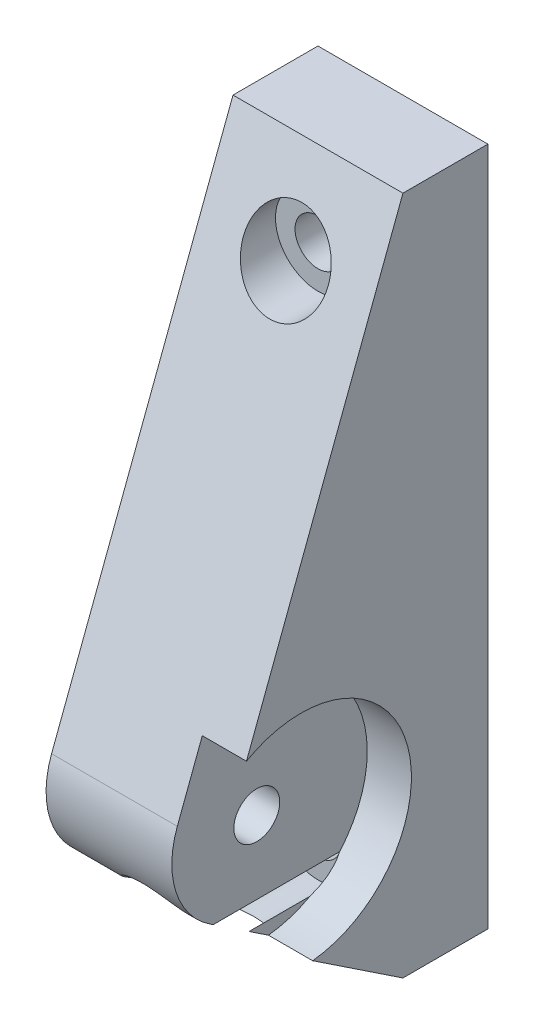
ISO-10303-21;
HEADER;
FILE_DESCRIPTION(('STEP AP214'),'2;1');
FILE_NAME('part.step','',(''),(''),'','','');
FILE_SCHEMA(('AUTOMOTIVE_DESIGN { 1 0 10303 214 1 1 1 1 }'));
ENDSEC;
DATA;
#1=APPLICATION_CONTEXT('core data for automotive mechanical design processes');
#2=APPLICATION_PROTOCOL_DEFINITION('international standard','automotive_design',2000,#1);
#3=PRODUCT_CONTEXT('',#1,'mechanical');
#4=PRODUCT('Part','Part','',(#3));
#5=PRODUCT_RELATED_PRODUCT_CATEGORY('part','',(#4));
#6=PRODUCT_DEFINITION_FORMATION('','',#4);
#7=PRODUCT_DEFINITION_CONTEXT('part definition',#1,'design');
#8=PRODUCT_DEFINITION('design','',#6,#7);
#9=PRODUCT_DEFINITION_SHAPE('','',#8);
#10=(LENGTH_UNIT() NAMED_UNIT(*) SI_UNIT(.MILLI.,.METRE.));
#11=(NAMED_UNIT(*) PLANE_ANGLE_UNIT() SI_UNIT($,.RADIAN.));
#12=(NAMED_UNIT(*) SI_UNIT($,.STERADIAN.) SOLID_ANGLE_UNIT());
#13=UNCERTAINTY_MEASURE_WITH_UNIT(LENGTH_MEASURE(1.E-05),#10,'distance_accuracy_value','');
#14=(GEOMETRIC_REPRESENTATION_CONTEXT(3) GLOBAL_UNCERTAINTY_ASSIGNED_CONTEXT((#13)) GLOBAL_UNIT_ASSIGNED_CONTEXT((#10,
#11,#12)) REPRESENTATION_CONTEXT('',''));
#15=CARTESIAN_POINT('',(0.,0.,0.));
#16=DIRECTION('',(0.,0.,1.));
#17=DIRECTION('',(1.,0.,0.));
#18=AXIS2_PLACEMENT_3D('',#15,#16,#17);
#19=CARTESIAN_POINT('',(10.,-50.,22.));
#20=DIRECTION('',(-1.,0.,0.));
#21=DIRECTION('',(0.,0.,1.));
#22=AXIS2_PLACEMENT_3D('',#19,#20,#21);
#23=CYLINDRICAL_SURFACE('',#22,10.);
#24=CARTESIAN_POINT('',(4.79999999999999,-50.,22.));
#25=DIRECTION('',(1.,0.,0.));
#26=DIRECTION('',(0.,1.,0.));
#27=AXIS2_PLACEMENT_3D('',#24,#25,#26);
#28=CIRCLE('',#27,10.);
#29=CARTESIAN_POINT('',(4.79999999999999,-46.4626425291299,31.353454021017));
#30=VERTEX_POINT('',#29);
#31=CARTESIAN_POINT('',(4.79999999999999,-58.3245531262586,27.5409218770976));
#32=VERTEX_POINT('',#31);
#33=EDGE_CURVE('E171',#30,#32,#28,.T.);
#34=ORIENTED_EDGE('',*,*,#33,.F.);
#35=DIRECTION('',(-1.,0.,0.));
#36=VECTOR('',#35,1.);
#37=CARTESIAN_POINT('',(10.,-46.4626425291299,31.353454021017));
#38=LINE('',#37,#36);
#39=CARTESIAN_POINT('',(-10.,-46.4626425291299,31.353454021017));
#40=VERTEX_POINT('',#39);
#41=EDGE_CURVE('E168',#30,#40,#38,.T.);
#42=ORIENTED_EDGE('',*,*,#41,.T.);
#43=CARTESIAN_POINT('',(-10.,-50.,22.));
#44=DIRECTION('',(1.,0.,0.));
#45=DIRECTION('',(0.,0.,-1.));
#46=AXIS2_PLACEMENT_3D('',#43,#44,#45);
#47=CIRCLE('',#46,10.);
#48=CARTESIAN_POINT('',(-10.,-58.3245531262586,27.5409218770976));
#49=VERTEX_POINT('',#48);
#50=EDGE_CURVE('E369',#40,#49,#47,.T.);
#51=ORIENTED_EDGE('',*,*,#50,.T.);
#52=DIRECTION('',(-1.,0.,0.));
#53=VECTOR('',#52,1.);
#54=CARTESIAN_POINT('',(10.,-58.3245531262586,27.5409218770976));
#55=LINE('',#54,#53);
#56=CARTESIAN_POINT('',(-4.71093173090738,-58.3245531262586,27.5409218770976));
#57=VERTEX_POINT('',#56);
#58=EDGE_CURVE('E284',#57,#49,#55,.T.);
#59=ORIENTED_EDGE('',*,*,#58,.F.);
#60=CARTESIAN_POINT('',(-5.,-60.,22.));
#61=CARTESIAN_POINT('',(-5.00000543735582,-59.9999983621273,22.2799909792406));
#62=CARTESIAN_POINT('',(-5.00004297263459,-59.9882299538663,22.5600554642195));
#63=CARTESIAN_POINT('',(-4.99970816004498,-59.9412202688655,23.1183407583302));
#64=CARTESIAN_POINT('',(-4.9993355628809,-59.9059647208023,23.3965603425891));
#65=CARTESIAN_POINT('',(-4.99668952871418,-59.812109081761,23.9497160845488));
#66=CARTESIAN_POINT('',(-4.99441157405625,-59.7534536821332,24.2246428620166));
#67=CARTESIAN_POINT('',(-4.98551463893992,-59.6132432445507,24.7684573945071));
#68=CARTESIAN_POINT('',(-4.9788970643154,-59.531695627495,25.0373470761009));
#69=CARTESIAN_POINT('',(-4.9599317049391,-59.3637682047245,25.5173615740895));
#70=CARTESIAN_POINT('',(-4.94889103440356,-59.2811615614769,25.7298638838736));
#71=CARTESIAN_POINT('',(-4.9195047352742,-59.1018149588431,26.1483449386991));
#72=CARTESIAN_POINT('',(-4.90115889024543,-59.0050745807618,26.3543234902618));
#73=CARTESIAN_POINT('',(-4.85464384182448,-58.7984935151088,26.7579190049121));
#74=CARTESIAN_POINT('',(-4.82649587778562,-58.6886814872442,26.9555530191938));
#75=CARTESIAN_POINT('',(-4.75749654580505,-58.457007869871,27.3413074982808));
#76=CARTESIAN_POINT('',(-4.71664995330747,-58.3351508217407,27.5294315085489));
#77=CARTESIAN_POINT('',(-4.63303812681507,-58.1173377336263,27.8424454268928));
#78=CARTESIAN_POINT('',(-4.59412152126642,-58.0238701997777,27.9701044781997));
#79=CARTESIAN_POINT('',(-4.50705728954444,-57.8326355912817,28.2188751390517));
#80=CARTESIAN_POINT('',(-4.45891200791514,-57.7348696135043,28.3399884015566));
#81=CARTESIAN_POINT('',(-4.35233542794369,-57.536291349379,28.5747954859367));
#82=CARTESIAN_POINT('',(-4.29391342330296,-57.4354818830569,28.6884958853243));
#83=CARTESIAN_POINT('',(-4.16578347926537,-57.2322082679789,28.9077854312126));
#84=CARTESIAN_POINT('',(-4.09607741161601,-57.1297443961813,29.0133759186717));
#85=CARTESIAN_POINT('',(-3.95724041310869,-56.9419742139825,29.1988477586529));
#86=CARTESIAN_POINT('',(-3.88994243634234,-56.8566489314387,29.2800840169888));
#87=CARTESIAN_POINT('',(-3.74673016345699,-56.6872507279237,29.4359882178753));
#88=CARTESIAN_POINT('',(-3.67081756846419,-56.6031775633935,29.5106574520628));
#89=CARTESIAN_POINT('',(-3.51029509598957,-56.4375393628271,29.6531053411727));
#90=CARTESIAN_POINT('',(-3.42568613275963,-56.355974064307,29.7208847189407));
#91=CARTESIAN_POINT('',(-3.24789296559,-56.1966544518305,29.8493277824221));
#92=CARTESIAN_POINT('',(-3.15470862709985,-56.1189001976999,29.9099913564522));
#93=CARTESIAN_POINT('',(-2.95965819367646,-55.9681661682869,30.0243372111332));
#94=CARTESIAN_POINT('',(-2.85775338900951,-55.895210525203,30.0779853745477));
#95=CARTESIAN_POINT('',(-2.64620776849355,-55.7557529090139,30.1779381937002));
#96=CARTESIAN_POINT('',(-2.53656680152415,-55.6892510620392,30.2242427059279));
#97=CARTESIAN_POINT('',(-2.31030709243293,-55.5638744415423,30.3095761633119));
#98=CARTESIAN_POINT('',(-2.19368820600765,-55.5049998258311,30.3486049579375));
#99=CARTESIAN_POINT('',(-1.95439083334124,-55.3959100941803,30.4195244224745));
#100=CARTESIAN_POINT('',(-1.83171277740433,-55.3456943644466,30.451415598391));
#101=CARTESIAN_POINT('',(-1.59193503972998,-55.2586278111119,30.505835706727));
#102=CARTESIAN_POINT('',(-1.47524234971891,-55.2210054314879,30.5289286685268));
#103=CARTESIAN_POINT('',(-1.23844580985075,-55.1542402042078,30.56944195571));
#104=CARTESIAN_POINT('',(-1.11834078412286,-55.1251003194417,30.5868602992323));
#105=CARTESIAN_POINT('',(-0.87571526448842,-55.0757292830475,30.6161358189671));
#106=CARTESIAN_POINT('',(-0.753196073350581,-55.0554934569729,30.6279959133587));
#107=CARTESIAN_POINT('',(-0.50654493283865,-55.0241712362418,30.6462728027366));
#108=CARTESIAN_POINT('',(-0.382412406281763,-55.0130882130005,30.6526875919806));
#109=CARTESIAN_POINT('',(-0.136302973633199,-55.0003737416911,30.6600412439671));
#110=CARTESIAN_POINT('',(-0.0143402508492899,-54.9985356552667,30.6610998292595));
#111=CARTESIAN_POINT('',(0.229374478277644,-55.0037765979291,30.6580730606772));
#112=CARTESIAN_POINT('',(0.351126392503349,-55.0108588509414,30.6539858470446));
#113=CARTESIAN_POINT('',(0.593451842660933,-55.0338525062965,30.640631055885));
#114=CARTESIAN_POINT('',(0.714025880758578,-55.0497599625952,30.6313657936234));
#115=CARTESIAN_POINT('',(0.953236669836751,-55.0902078067717,30.6075742444877));
#116=CARTESIAN_POINT('',(1.07187269289389,-55.1147513637677,30.5930460262524));
#117=CARTESIAN_POINT('',(1.30614382742046,-55.1721112716913,30.5586436026435));
#118=CARTESIAN_POINT('',(1.42178316581298,-55.2049151819101,30.5387774336318));
#119=CARTESIAN_POINT('',(1.64947623860589,-55.2783960203729,30.4935502475042));
#120=CARTESIAN_POINT('',(1.7615286546631,-55.3190758054752,30.4681872360894));
#121=CARTESIAN_POINT('',(1.98118032869369,-55.4077300592597,30.4118493735791));
#122=CARTESIAN_POINT('',(2.08878182196989,-55.4557008083377,30.3808773824617));
#123=CARTESIAN_POINT('',(2.29892441489056,-55.5583082066549,30.3131816033112));
#124=CARTESIAN_POINT('',(2.40146364310403,-55.6129472955266,30.2764557087924));
#125=CARTESIAN_POINT('',(2.60145574661091,-55.7284848075023,30.1969142542764));
#126=CARTESIAN_POINT('',(2.69887209426639,-55.7894208566242,30.1540614224923));
#127=CARTESIAN_POINT('',(2.88739972524779,-55.916390383908,30.0624111661055));
#128=CARTESIAN_POINT('',(2.97850872467237,-55.9824256903988,30.0136116056551));
#129=CARTESIAN_POINT('',(3.24164297734024,-56.1867459086094,29.8583271531288));
#130=CARTESIAN_POINT('',(3.40366461179998,-56.3313567600175,29.7428820173478));
#131=CARTESIAN_POINT('',(3.70609907357402,-56.6364761533102,29.4832597940605));
#132=CARTESIAN_POINT('',(3.84510641287463,-56.797414325243,29.3379719520428));
#133=CARTESIAN_POINT('',(4.09276106005842,-57.1206238184767,29.0247650499011));
#134=CARTESIAN_POINT('',(4.20139390313721,-57.2828957371927,28.8568352635627));
#135=CARTESIAN_POINT('',(4.36532741700057,-57.5582461964004,28.5500523165634));
#136=CARTESIAN_POINT('',(4.4270934949573,-57.6726739462544,28.4157556050742));
#137=CARTESIAN_POINT('',(4.53777569652121,-57.8966240337978,28.1380071929284));
#138=CARTESIAN_POINT('',(4.58668703450769,-58.0061445320423,27.9945521073839));
#139=CARTESIAN_POINT('',(4.6734146059691,-58.2188696801919,27.6994170226748));
#140=CARTESIAN_POINT('',(4.71120893103198,-58.3220615457724,27.5477214713544));
#141=CARTESIAN_POINT('',(4.77732993575131,-58.5207830607504,27.2373879658764));
#142=CARTESIAN_POINT('',(4.80565400908331,-58.6163105953455,27.0787481141285));
#143=CARTESIAN_POINT('',(4.8633191056043,-58.831800549952,26.6971345651726));
#144=CARTESIAN_POINT('',(4.88933813032538,-58.9481395417289,26.4716050188093));
#145=CARTESIAN_POINT('',(4.93077464998759,-59.1636377505289,26.0115266765605));
#146=CARTESIAN_POINT('',(4.94618838709179,-59.2627908686755,25.7769747147593));
#147=CARTESIAN_POINT('',(4.96971470524354,-59.4430430356523,25.3005798049917));
#148=CARTESIAN_POINT('',(4.97782404911881,-59.5241340677278,25.0587336734054));
#149=CARTESIAN_POINT('',(4.98945866655492,-59.6676114757841,24.5694901131549));
#150=CARTESIAN_POINT('',(4.99298437385522,-59.7299996211481,24.3220932120019));
#151=CARTESIAN_POINT('',(4.9976275476374,-59.8367858439264,23.8180679417996));
#152=CARTESIAN_POINT('',(4.99869362325633,-59.8807845562404,23.5613545001888));
#153=CARTESIAN_POINT('',(4.99985121717598,-59.948625069996,23.0452743331978));
#154=CARTESIAN_POINT('',(4.9999427182657,-59.9724665154534,22.7859075610406));
#155=CARTESIAN_POINT('',(5.00001895348314,-59.9998465167762,22.2660963089851));
#156=CARTESIAN_POINT('',(5.00000368487963,-60.0033845532645,22.005651801688));
#157=CARTESIAN_POINT('',(4.99999421575296,-59.9901356284506,21.485279692529));
#158=CARTESIAN_POINT('',(5.00000001567211,-59.9733482404514,21.2253521016337));
#159=CARTESIAN_POINT('',(4.99940341740606,-59.9173917460965,20.6868510444563));
#160=CARTESIAN_POINT('',(4.9987522819036,-59.8765381076326,20.4084511165086));
#161=CARTESIAN_POINT('',(4.99505249621834,-59.7715157964289,19.8560465364209));
#162=CARTESIAN_POINT('',(4.992003421574,-59.7073429970237,19.582042671195));
#163=CARTESIAN_POINT('',(4.98083992229349,-59.5561818578722,19.0405406474245));
#164=CARTESIAN_POINT('',(4.97272625234231,-59.4691969185259,18.7730415257645));
#165=CARTESIAN_POINT('',(4.94787567551777,-59.2731634682736,18.2467058150375));
#166=CARTESIAN_POINT('',(4.93114206960752,-59.1641234129695,17.9878659503281));
#167=CARTESIAN_POINT('',(4.8913640983522,-58.9598065950638,17.5546103834037));
#168=CARTESIAN_POINT('',(4.87155006232064,-58.8696868626302,17.3774510704501));
#169=CARTESIAN_POINT('',(4.82349827866207,-58.6795912705167,17.0296954947859));
#170=CARTESIAN_POINT('',(4.79526260033573,-58.5796178360477,16.8590976314582));
#171=CARTESIAN_POINT('',(4.72843256766302,-58.3709182123089,16.5258504237983));
#172=CARTESIAN_POINT('',(4.68985655057786,-58.2622077536963,16.3631876054988));
#173=CARTESIAN_POINT('',(4.60022849682021,-58.0372085317342,16.0467723265841));
#174=CARTESIAN_POINT('',(4.54917984137825,-57.9209218284978,15.8930174650464));
#175=CARTESIAN_POINT('',(4.44645616373268,-57.7110651116969,15.6312848797945));
#176=CARTESIAN_POINT('',(4.39783792791745,-57.6186965853337,15.5211392453894));
#177=CARTESIAN_POINT('',(4.29131827610624,-57.4317009590116,15.3074700244708));
#178=CARTESIAN_POINT('',(4.23341930224405,-57.3370744587762,15.2039447058853));
#179=CARTESIAN_POINT('',(4.10760240581564,-57.1468257536199,15.0041506164665));
#180=CARTESIAN_POINT('',(4.03968574031347,-57.0512036750258,14.9078809374506));
#181=CARTESIAN_POINT('',(3.8932785096194,-56.8604403719002,14.7231886948359));
#182=CARTESIAN_POINT('',(3.81478783115176,-56.7652991525314,14.6347662153182));
#183=CARTESIAN_POINT('',(3.64617388441189,-56.5763187985001,14.465528022276));
#184=CARTESIAN_POINT('',(3.55595103204989,-56.4824994590982,14.3847890579905));
#185=CARTESIAN_POINT('',(3.36445734878322,-56.2989170341731,14.2322530850792));
#186=CARTESIAN_POINT('',(3.26318623510566,-56.2091540525529,14.1604563054234));
#187=CARTESIAN_POINT('',(3.05002395623394,-56.0356298263225,14.0260915807756));
#188=CARTESIAN_POINT('',(2.93813769862896,-55.9518658393897,13.9635194049107));
#189=CARTESIAN_POINT('',(2.70443645380492,-55.7921450049577,13.8476508258962));
#190=CARTESIAN_POINT('',(2.58262307369867,-55.71618689824,13.7943529256868));
#191=CARTESIAN_POINT('',(2.34833757981186,-55.5840395131709,13.7039793943331));
#192=CARTESIAN_POINT('',(2.2370527484488,-55.5265791273199,13.6656727249594));
#193=CARTESIAN_POINT('',(2.00876865681304,-55.4195266499953,13.5956663871247));
#194=CARTESIAN_POINT('',(1.89176984687731,-55.3699339397496,13.5639661990196));
#195=CARTESIAN_POINT('',(1.65297590155663,-55.2794095282919,13.5070207258276));
#196=CARTESIAN_POINT('',(1.53118161225277,-55.2384763073095,13.4817743079193));
#197=CARTESIAN_POINT('',(1.28374749585496,-55.1658906173589,13.4375597536905));
#198=CARTESIAN_POINT('',(1.15810774510917,-55.1342379642654,13.418591492811));
#199=CARTESIAN_POINT('',(0.911945408817211,-55.0823605241731,13.3877724955207));
#200=CARTESIAN_POINT('',(0.79159293526991,-55.0615457360818,13.3755513880955));
#201=CARTESIAN_POINT('',(0.549231822148058,-55.028752503991,13.3563890385459));
#202=CARTESIAN_POINT('',(0.427222652964941,-55.0167769568155,13.3494495272998));
#203=CARTESIAN_POINT('',(0.182531354187693,-55.0018303520892,13.3407986650838));
#204=CARTESIAN_POINT('',(0.0598495893349167,-54.9988548206499,13.3390847164945));
#205=CARTESIAN_POINT('',(-0.185408496514473,-55.0019334622896,13.3408623470437));
#206=CARTESIAN_POINT('',(-0.307984762065647,-55.0079909599969,13.3443558427946));
#207=CARTESIAN_POINT('',(-0.55117134675429,-55.0289848181052,13.3565367452333));
#208=CARTESIAN_POINT('',(-0.671789528193169,-55.0438532507725,13.3651844188043));
#209=CARTESIAN_POINT('',(-0.911192613539106,-55.0822332626403,13.3877180884489));
#210=CARTESIAN_POINT('',(-1.02997683299697,-55.1057479911647,13.4016059932708));
#211=CARTESIAN_POINT('',(-1.26477080733836,-55.1611058951487,13.4347198290215));
#212=CARTESIAN_POINT('',(-1.38078180290759,-55.1929452672285,13.4539433224622));
#213=CARTESIAN_POINT('',(-1.6093131329864,-55.2645533690793,13.4978684373472));
#214=CARTESIAN_POINT('',(-1.72183217531281,-55.3043249946535,13.5225720597761));
#215=CARTESIAN_POINT('',(-1.94264343095203,-55.3912879466228,13.5776094853225));
#216=CARTESIAN_POINT('',(-2.05093244271,-55.4384847620651,13.6079474566327));
#217=CARTESIAN_POINT('',(-2.26251772937766,-55.5396447215201,13.6743770756661));
#218=CARTESIAN_POINT('',(-2.36581217354962,-55.5936103209403,13.7104708126159));
#219=CARTESIAN_POINT('',(-2.56668194460778,-55.7075103387207,13.7884785590019));
#220=CARTESIAN_POINT('',(-2.66426000858945,-55.767441862774,13.8303897500148));
#221=CARTESIAN_POINT('',(-2.85325034521811,-55.8924694386845,13.9201035360479));
#222=CARTESIAN_POINT('',(-2.94466040762755,-55.9575673238585,13.9679082257746));
#223=CARTESIAN_POINT('',(-3.1225606613433,-56.0932922959295,14.0703630300312));
#224=CARTESIAN_POINT('',(-3.20892281630988,-56.1640015017397,14.1251268811224));
#225=CARTESIAN_POINT('',(-3.37450768281391,-56.3088182237937,14.2406552578269));
#226=CARTESIAN_POINT('',(-3.45372741847667,-56.3829271372934,14.3014222627456));
#227=CARTESIAN_POINT('',(-3.68038900580261,-56.6088192342266,14.4925265325462));
#228=CARTESIAN_POINT('',(-3.81696267205468,-56.764268957373,14.6317415732882));
#229=CARTESIAN_POINT('',(-4.00550411253702,-57.0053974721672,14.8628868634923));
#230=CARTESIAN_POINT('',(-4.06764733839662,-57.0905569471211,14.9474186901127));
#231=CARTESIAN_POINT('',(-4.18389683179598,-57.2603706682556,15.1223667898039));
#232=CARTESIAN_POINT('',(-4.23800281664755,-57.3450248965651,15.2127832696906));
#233=CARTESIAN_POINT('',(-4.33863603806454,-57.5128679514617,15.3990495621269));
#234=CARTESIAN_POINT('',(-4.38516131905166,-57.5960563950029,15.4949007680923));
#235=CARTESIAN_POINT('',(-4.47121065826034,-57.7601654664286,15.6915731696651));
#236=CARTESIAN_POINT('',(-4.51073324306758,-57.8410856140406,15.7923954055196));
#237=CARTESIAN_POINT('',(-4.6041191798885,-58.0452840933308,16.0573486381729));
#238=CARTESIAN_POINT('',(-4.65331332649454,-58.1664114838724,16.2248041895108));
#239=CARTESIAN_POINT('',(-4.73851734440915,-58.3994195220795,16.5692490348584));
#240=CARTESIAN_POINT('',(-4.77452111108903,-58.5112958697783,16.746242699837));
#241=CARTESIAN_POINT('',(-4.83590533809173,-58.7247027610216,17.1087904919527));
#242=CARTESIAN_POINT('',(-4.86125546661147,-58.8262031507256,17.2943674133578));
#243=CARTESIAN_POINT('',(-4.9035056621985,-59.0175408120546,17.6723163966178));
#244=CARTESIAN_POINT('',(-4.92040604372667,-59.1073785176191,17.8646882053129));
#245=CARTESIAN_POINT('',(-4.95177166994207,-59.2986618244495,18.3109049208574));
#246=CARTESIAN_POINT('',(-4.96416424821706,-59.3960991784792,18.5666206012138));
#247=CARTESIAN_POINT('',(-4.98221957755615,-59.5697592495341,19.0854494901649));
#248=CARTESIAN_POINT('',(-4.98787974171828,-59.6459738031775,19.348565502581));
#249=CARTESIAN_POINT('',(-4.99542526174576,-59.7764266540513,19.8796045735623));
#250=CARTESIAN_POINT('',(-4.99731901304157,-59.8307136125368,20.1475155947845));
#251=CARTESIAN_POINT('',(-4.99950188184151,-59.9171515401133,20.6867582698915));
#252=CARTESIAN_POINT('',(-4.9997919577134,-59.9493157198669,20.95808778366));
#253=CARTESIAN_POINT('',(-4.99996841907762,-59.9802148787248,21.358267590223));
#254=CARTESIAN_POINT('',(-4.99998722241698,-59.9876327898371,21.4864992574349));
#255=CARTESIAN_POINT('',(-5.00000176545303,-59.99752565041,21.7431487981879));
#256=CARTESIAN_POINT('',(-4.9999975058563,-60.0000007513008,21.8715666659039));
#257=CARTESIAN_POINT('',(-5.,-60.,22.));
#258=B_SPLINE_CURVE_WITH_KNOTS('',3,(#60,#61,#62,#63,#64,#65,#66,#67,#68,#69,#70,#71,#72,#73,
#74,#75,#76,#77,#78,#79,#80,#81,#82,#83,#84,#85,#86,#87,#88,#89,#90,#91,#92,#93,#94,#95,#96,#97,
#98,#99,#100,#101,#102,#103,#104,#105,#106,#107,#108,#109,#110,#111,#112,#113,#114,#115,#116,
#117,#118,#119,#120,#121,#122,#123,#124,#125,#126,#127,#128,#129,#130,#131,#132,#133,#134,#135,
#136,#137,#138,#139,#140,#141,#142,#143,#144,#145,#146,#147,#148,#149,#150,#151,#152,#153,#154,
#155,#156,#157,#158,#159,#160,#161,#162,#163,#164,#165,#166,#167,#168,#169,#170,#171,#172,#173,
#174,#175,#176,#177,#178,#179,#180,#181,#182,#183,#184,#185,#186,#187,#188,#189,#190,#191,#192,
#193,#194,#195,#196,#197,#198,#199,#200,#201,#202,#203,#204,#205,#206,#207,#208,#209,#210,#211,
#212,#213,#214,#215,#216,#217,#218,#219,#220,#221,#222,#223,#224,#225,#226,#227,#228,#229,#230,
#231,#232,#233,#234,#235,#236,#237,#238,#239,#240,#241,#242,#243,#244,#245,#246,#247,#248,#249,
#250,#251,#252,#253,#254,#255,#256,#257),.UNSPECIFIED.,.T.,.F.,(4,2,2,2,2,2,2,2,2,2,2,2,2,2,2,2,
2,2,2,2,2,2,2,2,2,2,2,2,2,2,2,2,2,2,2,2,2,2,2,2,2,2,2,2,2,2,2,2,2,2,2,2,2,2,2,2,2,2,2,2,2,2,2,2,
2,2,2,2,2,2,2,2,2,2,2,2,2,2,2,2,2,2,2,2,2,2,2,2,2,2,2,2,2,2,2,2,2,2,4),(0.,0.839854082794809,
1.68021894615517,2.52258200472724,3.36467231178483,4.04886548622183,4.73307893318347,
5.41581894921268,6.09830252408673,6.58671064131151,7.07499484257068,7.56283971568059,
8.05060375013158,8.45723472268407,8.86378553720438,9.2702936545437,9.67680815121662,
10.0852313871652,10.4936626035798,10.9021022692778,11.3105129703938,11.6843480370782,
12.0583135260908,12.4320824560505,12.8059890016646,13.1714998267601,13.5371427900889,
13.9026223938135,14.2682362546618,14.6333027331258,14.9985018830564,15.3635153422146,
15.7286627452466,16.0961342433306,16.4637381149066,17.1982583981912,17.9679361279897,
18.7379797683634,19.298063334938,19.8583551175392,20.4197437867831,20.9812868298512,
21.7454860983972,22.5099560111201,23.2747645563408,24.0395007241417,24.8200757771336,
25.6006646150637,26.3812734209841,27.161898614715,28.005030659885,28.8483119822776,
29.6914676757031,30.5343007264674,31.1330853181193,31.731722902099,32.3293058233289,
32.9267269240996,33.3815761589062,33.8363059005601,34.2909786291921,34.7456562289625,
35.2044815263627,35.6633185698472,36.1219445081816,36.5804963459917,36.9729010209589,
37.3652748190071,37.7575796968595,38.1498767908992,38.5176866718307,38.8856170391214,
39.253364478931,39.6212473024846,39.9863301774456,40.3515461620113,40.7165955766663,
41.081778503525,41.4472326702827,41.8128197927232,42.178230410798,42.5437712820247,
42.9163252213777,43.2890336741044,44.0339151818247,44.4390141879709,44.8441274390054,
45.2493450313635,45.6546477832373,46.2910068136749,46.9276599859648,47.5661136810234,
48.2045436139911,49.0252389809783,49.8462495949597,50.6654280950577,51.4841169953405,
51.8693742813495,52.2546197642578),.UNSPECIFIED.);
#259=CARTESIAN_POINT('',(4.71093173090738,-58.3245531262586,27.5409218770976));
#260=VERTEX_POINT('',#259);
#261=EDGE_CURVE('E198',#57,#260,#258,.T.);
#262=ORIENTED_EDGE('',*,*,#261,.T.);
#263=EDGE_CURVE('E255',#32,#260,#55,.T.);
#264=ORIENTED_EDGE('',*,*,#263,.F.);
#265=EDGE_LOOP('',(#34,#42,#51,#59,#262,#264));
#266=FACE_BOUND('',#265,.T.);
#267=ADVANCED_FACE('F41',(#266),#23,.T.);
#268=CARTESIAN_POINT('',(10.,-58.3245531262586,27.5409218770976));
#269=DIRECTION('',(0.,0.832455312625856,-0.554092187709761));
#270=DIRECTION('',(0.,0.554092187709761,0.832455312625856));
#271=AXIS2_PLACEMENT_3D('',#268,#269,#270);
#272=PLANE('',#271);
#273=DIRECTION('',(0.,-0.554092187709761,-0.832455312625856));
#274=VECTOR('',#273,1.);
#275=CARTESIAN_POINT('',(4.79999999999999,-58.3245531262586,27.5409218770976));
#276=LINE('',#275,#274);
#277=CARTESIAN_POINT('',(4.79999999999999,-58.6,27.1270968521681));
#278=VERTEX_POINT('',#277);
#279=EDGE_CURVE('E60',#32,#278,#276,.T.);
#280=ORIENTED_EDGE('',*,*,#279,.F.);
#281=ORIENTED_EDGE('',*,*,#263,.T.);
#282=CARTESIAN_POINT('',(0.,-60.,25.0237691685685));
#283=DIRECTION('',(0.,0.832455312625856,-0.554092187709761));
#284=DIRECTION('',(0.,-0.554092187709761,-0.832455312625856));
#285=AXIS2_PLACEMENT_3D('',#282,#283,#284);
#286=ELLIPSE('',#285,9.02376916856849,5.);
#287=EDGE_CURVE('E258',#260,#278,#286,.T.);
#288=ORIENTED_EDGE('',*,*,#287,.T.);
#289=EDGE_LOOP('',(#280,#281,#288));
#290=FACE_BOUND('',#289,.T.);
#291=ADVANCED_FACE('F247',(#290),#272,.F.);
#292=CARTESIAN_POINT('',(10.,-50.,22.));
#293=DIRECTION('',(-1.,0.,0.));
#294=DIRECTION('',(0.,0.,1.));
#295=AXIS2_PLACEMENT_3D('',#292,#293,#294);
#296=CYLINDRICAL_SURFACE('',#295,2.70000000000001);
#297=CARTESIAN_POINT('',(-10.,-50.,22.));
#298=DIRECTION('',(1.,0.,0.));
#299=DIRECTION('',(0.,0.,-1.));
#300=AXIS2_PLACEMENT_3D('',#297,#298,#299);
#301=CIRCLE('',#300,2.70000000000001);
#302=CARTESIAN_POINT('',(-10.,-50.,19.3));
#303=VERTEX_POINT('',#302);
#304=EDGE_CURVE('E373',#303,#303,#301,.T.);
#305=ORIENTED_EDGE('',*,*,#304,.F.);
#306=EDGE_LOOP('',(#305));
#307=FACE_BOUND('',#306,.T.);
#308=CARTESIAN_POINT('',(4.79999999999999,-50.,22.));
#309=DIRECTION('',(1.,0.,0.));
#310=DIRECTION('',(0.,1.,0.));
#311=AXIS2_PLACEMENT_3D('',#308,#309,#310);
#312=CIRCLE('',#311,2.70000000000001);
#313=CARTESIAN_POINT('',(4.79999999999999,-47.3,22.));
#314=VERTEX_POINT('',#313);
#315=EDGE_CURVE('E176',#314,#314,#312,.T.);
#316=ORIENTED_EDGE('',*,*,#315,.T.);
#317=EDGE_LOOP('',(#316));
#318=FACE_BOUND('',#317,.T.);
#319=ADVANCED_FACE('F217',(#307,#318),#296,.F.);
#320=CARTESIAN_POINT('',(0.,-60.,32.));
#321=DIRECTION('',(0.,0.,-1.));
#322=DIRECTION('',(-1.,0.,0.));
#323=AXIS2_PLACEMENT_3D('',#320,#321,#322);
#324=CYLINDRICAL_SURFACE('',#323,5.);
#325=CARTESIAN_POINT('',(0.,-60.,10.));
#326=DIRECTION('',(0.,0.,-1.));
#327=DIRECTION('',(-1.,0.,0.));
#328=AXIS2_PLACEMENT_3D('',#325,#326,#327);
#329=CIRCLE('',#328,5.);
#330=CARTESIAN_POINT('',(-5.,-60.,10.));
#331=VERTEX_POINT('',#330);
#332=EDGE_CURVE('E194',#331,#331,#329,.T.);
#333=ORIENTED_EDGE('',*,*,#332,.T.);
#334=EDGE_LOOP('',(#333));
#335=FACE_BOUND('',#334,.T.);
#336=DIRECTION('',(0.,0.,-1.));
#337=VECTOR('',#336,1.);
#338=CARTESIAN_POINT('',(4.79999999999999,-61.4,32.));
#339=LINE('',#338,#337);
#340=CARTESIAN_POINT('',(4.79999999999999,-61.4,15.7518002592747));
#341=VERTEX_POINT('',#340);
#342=CARTESIAN_POINT('',(4.79999999999999,-61.4,22.9204414849689));
#343=VERTEX_POINT('',#342);
#344=EDGE_CURVE('E11',#341,#343,#339,.F.);
#345=ORIENTED_EDGE('',*,*,#344,.F.);
#346=CARTESIAN_POINT('',(4.79999999999999,-61.4,15.7518002592747));
#347=CARTESIAN_POINT('',(4.82083168131789,-61.3285660910259,15.6214704994124));
#348=CARTESIAN_POINT('',(4.84060981292041,-61.2548337715501,15.4922448802154));
#349=CARTESIAN_POINT('',(4.87750012646439,-61.1027792610663,15.2360883256162));
#350=CARTESIAN_POINT('',(4.89461157783192,-61.0244558203165,15.1091580274387));
#351=CARTESIAN_POINT('',(4.94120510087942,-60.7820747284133,14.7311178116487));
#352=CARTESIAN_POINT('',(4.96578407222817,-60.6111341289216,14.4837229330927));
#353=CARTESIAN_POINT('',(4.99648443823439,-60.256753780958,14.0072048844272));
#354=CARTESIAN_POINT('',(5.00308895015903,-60.0737795307321,13.7777679661931));
#355=CARTESIAN_POINT('',(4.99419530657937,-59.6931801616539,13.3323739674558));
#356=CARTESIAN_POINT('',(4.97874298327978,-59.4955862295016,13.116389905517));
#357=CARTESIAN_POINT('',(4.93363472474345,-59.1802561707802,12.7941074517677));
#358=CARTESIAN_POINT('',(4.9135372525814,-59.066728608053,12.6823013065325));
#359=CARTESIAN_POINT('',(4.86403402789924,-58.8358681233977,12.4630697451041));
#360=CARTESIAN_POINT('',(4.83456066765984,-58.7185132994262,12.3556827529691));
#361=CARTESIAN_POINT('',(4.79999999999999,-58.6,12.2511539144368));
#362=B_SPLINE_CURVE_WITH_KNOTS('',3,(#346,#347,#348,#349,#350,#351,#352,#353,#354,#355,#356,
#357,#358,#359,#360,#361),.UNSPECIFIED.,.F.,.F.,(4,2,2,2,2,2,2,4),(0.,0.450172662840693,
0.900468440715618,1.80438455366518,2.68375344363145,3.56129773850251,4.04276975286438,
4.52779541574748),.UNSPECIFIED.);
#363=CARTESIAN_POINT('',(4.79999999999999,-58.6,12.2511539144368));
#364=VERTEX_POINT('',#363);
#365=EDGE_CURVE('E50',#341,#364,#362,.T.);
#366=ORIENTED_EDGE('',*,*,#365,.T.);
#367=DIRECTION('',(0.,0.,-1.));
#368=VECTOR('',#367,1.);
#369=CARTESIAN_POINT('',(4.79999999999999,-58.6,32.));
#370=LINE('',#369,#368);
#371=EDGE_CURVE('E161',#278,#364,#370,.T.);
#372=ORIENTED_EDGE('',*,*,#371,.F.);
#373=ORIENTED_EDGE('',*,*,#287,.F.);
#374=ORIENTED_EDGE('',*,*,#261,.F.);
#375=EDGE_CURVE('E71',#343,#57,#286,.T.);
#376=ORIENTED_EDGE('',*,*,#375,.F.);
#377=EDGE_LOOP('',(#345,#366,#372,#373,#374,#376));
#378=FACE_BOUND('',#377,.T.);
#379=ADVANCED_FACE('F211',(#335,#378),#324,.F.);
#380=CARTESIAN_POINT('',(0.,0.,0.));
#381=DIRECTION('',(0.,0.,1.));
#382=DIRECTION('',(1.,0.,0.));
#383=AXIS2_PLACEMENT_3D('',#380,#381,#382);
#384=PLANE('',#383);
#385=DIRECTION('',(0.,-1.,0.));
#386=VECTOR('',#385,1.);
#387=CARTESIAN_POINT('',(-10.,10.,0.));
#388=LINE('',#387,#386);
#389=CARTESIAN_POINT('',(-10.,10.,0.));
#390=VERTEX_POINT('',#389);
#391=CARTESIAN_POINT('',(-9.99999999999999,-70.,0.));
#392=VERTEX_POINT('',#391);
#393=EDGE_CURVE('E268',#390,#392,#388,.T.);
#394=ORIENTED_EDGE('',*,*,#393,.F.);
#395=DIRECTION('',(-1.,0.,0.));
#396=VECTOR('',#395,1.);
#397=CARTESIAN_POINT('',(-10.,10.,0.));
#398=LINE('',#397,#396);
#399=CARTESIAN_POINT('',(10.,10.,0.));
#400=VERTEX_POINT('',#399);
#401=EDGE_CURVE('E275',#400,#390,#398,.T.);
#402=ORIENTED_EDGE('',*,*,#401,.F.);
#403=DIRECTION('',(0.,1.,0.));
#404=VECTOR('',#403,1.);
#405=CARTESIAN_POINT('',(10.,10.,0.));
#406=LINE('',#405,#404);
#407=CARTESIAN_POINT('',(9.99999999999999,-70.,0.));
#408=VERTEX_POINT('',#407);
#409=EDGE_CURVE('E274',#408,#400,#406,.T.);
#410=ORIENTED_EDGE('',*,*,#409,.F.);
#411=DIRECTION('',(1.,0.,0.));
#412=VECTOR('',#411,1.);
#413=CARTESIAN_POINT('',(-9.99999999999999,-70.,0.));
#414=LINE('',#413,#412);
#415=EDGE_CURVE('E276',#392,#408,#414,.T.);
#416=ORIENTED_EDGE('',*,*,#415,.F.);
#417=EDGE_LOOP('',(#394,#402,#410,#416));
#418=FACE_BOUND('',#417,.T.);
#419=CARTESIAN_POINT('',(0.,0.,0.));
#420=DIRECTION('',(0.,0.,1.));
#421=DIRECTION('',(1.,0.,0.));
#422=AXIS2_PLACEMENT_3D('',#419,#420,#421);
#423=CIRCLE('',#422,2.7);
#424=CARTESIAN_POINT('',(2.7,0.,0.));
#425=VERTEX_POINT('',#424);
#426=EDGE_CURVE('E272',#425,#425,#423,.T.);
#427=ORIENTED_EDGE('',*,*,#426,.T.);
#428=EDGE_LOOP('',(#427));
#429=FACE_BOUND('',#428,.T.);
#430=CARTESIAN_POINT('',(0.,-60.,0.));
#431=DIRECTION('',(0.,0.,1.));
#432=DIRECTION('',(1.,0.,0.));
#433=AXIS2_PLACEMENT_3D('',#430,#431,#432);
#434=CIRCLE('',#433,2.7);
#435=CARTESIAN_POINT('',(2.7,-60.,0.));
#436=VERTEX_POINT('',#435);
#437=EDGE_CURVE('E269',#436,#436,#434,.T.);
#438=ORIENTED_EDGE('',*,*,#437,.T.);
#439=EDGE_LOOP('',(#438));
#440=FACE_BOUND('',#439,.T.);
#441=ADVANCED_FACE('F216',(#418,#429,#440),#384,.F.);
#442=CARTESIAN_POINT('',(-10.,10.,10.));
#443=DIRECTION('',(1.,0.,0.));
#444=DIRECTION('',(0.,1.,0.));
#445=AXIS2_PLACEMENT_3D('',#442,#443,#444);
#446=PLANE('',#445);
#447=ORIENTED_EDGE('',*,*,#393,.T.);
#448=DIRECTION('',(0.,0.,-1.));
#449=VECTOR('',#448,1.);
#450=CARTESIAN_POINT('',(-9.99999999999999,-70.,10.));
#451=LINE('',#450,#449);
#452=CARTESIAN_POINT('',(-9.99999999999999,-70.,10.));
#453=VERTEX_POINT('',#452);
#454=EDGE_CURVE('E289',#453,#392,#451,.T.);
#455=ORIENTED_EDGE('',*,*,#454,.F.);
#456=DIRECTION('',(0.,-0.554092187709761,-0.832455312625856));
#457=VECTOR('',#456,1.);
#458=CARTESIAN_POINT('',(-10.,-58.3245531262586,27.5409218770976));
#459=LINE('',#458,#457);
#460=EDGE_CURVE('E281',#49,#453,#459,.T.);
#461=ORIENTED_EDGE('',*,*,#460,.F.);
#462=ORIENTED_EDGE('',*,*,#50,.F.);
#463=DIRECTION('',(0.,-0.935345402101703,0.353735747087007));
#464=VECTOR('',#463,1.);
#465=CARTESIAN_POINT('',(-10.,10.,10.));
#466=LINE('',#465,#464);
#467=CARTESIAN_POINT('',(-10.,10.,10.));
#468=VERTEX_POINT('',#467);
#469=EDGE_CURVE('E356',#468,#40,#466,.T.);
#470=ORIENTED_EDGE('',*,*,#469,.F.);
#471=DIRECTION('',(0.,0.,-1.));
#472=VECTOR('',#471,1.);
#473=CARTESIAN_POINT('',(-10.,10.,10.));
#474=LINE('',#473,#472);
#475=EDGE_CURVE('E351',#468,#390,#474,.T.);
#476=ORIENTED_EDGE('',*,*,#475,.T.);
#477=EDGE_LOOP('',(#447,#455,#461,#462,#470,#476));
#478=FACE_BOUND('',#477,.T.);
#479=ORIENTED_EDGE('',*,*,#304,.T.);
#480=EDGE_LOOP('',(#479));
#481=FACE_BOUND('',#480,.T.);
#482=ADVANCED_FACE('F43',(#478,#481),#446,.F.);
#483=CARTESIAN_POINT('',(-9.99999999999999,-70.,10.));
#484=DIRECTION('',(0.,1.,0.));
#485=DIRECTION('',(0.,0.,1.));
#486=AXIS2_PLACEMENT_3D('',#483,#484,#485);
#487=PLANE('',#486);
#488=ORIENTED_EDGE('',*,*,#415,.T.);
#489=DIRECTION('',(0.,0.,-1.));
#490=VECTOR('',#489,1.);
#491=CARTESIAN_POINT('',(9.99999999999999,-70.,10.));
#492=LINE('',#491,#490);
#493=CARTESIAN_POINT('',(9.99999999999999,-70.,10.));
#494=VERTEX_POINT('',#493);
#495=EDGE_CURVE('E330',#494,#408,#492,.T.);
#496=ORIENTED_EDGE('',*,*,#495,.F.);
#497=DIRECTION('',(1.,0.,0.));
#498=VECTOR('',#497,1.);
#499=CARTESIAN_POINT('',(-9.99999999999999,-70.,10.));
#500=LINE('',#499,#498);
#501=EDGE_CURVE('E345',#453,#494,#500,.T.);
#502=ORIENTED_EDGE('',*,*,#501,.F.);
#503=ORIENTED_EDGE('',*,*,#454,.T.);
#504=EDGE_LOOP('',(#488,#496,#502,#503));
#505=FACE_BOUND('',#504,.T.);
#506=ADVANCED_FACE('F319',(#505),#487,.F.);
#507=CARTESIAN_POINT('',(10.,10.,10.));
#508=DIRECTION('',(-1.,0.,0.));
#509=DIRECTION('',(0.,-1.,0.));
#510=AXIS2_PLACEMENT_3D('',#507,#508,#509);
#511=PLANE('',#510);
#512=DIRECTION('',(0.,-0.935345402101703,0.353735747087007));
#513=VECTOR('',#512,1.);
#514=CARTESIAN_POINT('',(10.,10.,10.));
#515=LINE('',#514,#513);
#516=CARTESIAN_POINT('',(10.,10.,10.));
#517=VERTEX_POINT('',#516);
#518=CARTESIAN_POINT('',(9.99999999999999,-38.6930800919612,28.4151042230969));
#519=VERTEX_POINT('',#518);
#520=EDGE_CURVE('E279',#517,#519,#515,.T.);
#521=ORIENTED_EDGE('',*,*,#520,.T.);
#522=CARTESIAN_POINT('',(9.99999999999999,-50.,22.));
#523=DIRECTION('',(1.,0.,0.));
#524=DIRECTION('',(0.,1.,0.));
#525=AXIS2_PLACEMENT_3D('',#522,#523,#524);
#526=CIRCLE('',#525,13.);
#527=CARTESIAN_POINT('',(9.99999999999999,-62.9271885149449,20.6260287124267));
#528=VERTEX_POINT('',#527);
#529=EDGE_CURVE('E149',#528,#519,#526,.T.);
#530=ORIENTED_EDGE('',*,*,#529,.F.);
#531=DIRECTION('',(0.,-0.554092187709761,-0.832455312625856));
#532=VECTOR('',#531,1.);
#533=CARTESIAN_POINT('',(10.,-58.3245531262586,27.5409218770976));
#534=LINE('',#533,#532);
#535=EDGE_CURVE('E280',#528,#494,#534,.T.);
#536=ORIENTED_EDGE('',*,*,#535,.T.);
#537=ORIENTED_EDGE('',*,*,#495,.T.);
#538=ORIENTED_EDGE('',*,*,#409,.T.);
#539=DIRECTION('',(0.,0.,-1.));
#540=VECTOR('',#539,1.);
#541=CARTESIAN_POINT('',(10.,10.,10.));
#542=LINE('',#541,#540);
#543=EDGE_CURVE('E341',#517,#400,#542,.T.);
#544=ORIENTED_EDGE('',*,*,#543,.F.);
#545=EDGE_LOOP('',(#521,#530,#536,#537,#538,#544));
#546=FACE_BOUND('',#545,.T.);
#547=ADVANCED_FACE('F316',(#546),#511,.F.);
#548=CARTESIAN_POINT('',(-10.,10.,10.));
#549=DIRECTION('',(0.,-1.,0.));
#550=DIRECTION('',(0.,0.,-1.));
#551=AXIS2_PLACEMENT_3D('',#548,#549,#550);
#552=PLANE('',#551);
#553=ORIENTED_EDGE('',*,*,#401,.T.);
#554=ORIENTED_EDGE('',*,*,#475,.F.);
#555=DIRECTION('',(-1.,0.,0.));
#556=VECTOR('',#555,1.);
#557=CARTESIAN_POINT('',(-10.,10.,10.));
#558=LINE('',#557,#556);
#559=EDGE_CURVE('E348',#517,#468,#558,.T.);
#560=ORIENTED_EDGE('',*,*,#559,.F.);
#561=ORIENTED_EDGE('',*,*,#543,.T.);
#562=EDGE_LOOP('',(#553,#554,#560,#561));
#563=FACE_BOUND('',#562,.T.);
#564=ADVANCED_FACE('F309',(#563),#552,.F.);
#565=CARTESIAN_POINT('',(0.,0.,10.));
#566=DIRECTION('',(0.,0.,-1.));
#567=DIRECTION('',(-1.,0.,0.));
#568=AXIS2_PLACEMENT_3D('',#565,#566,#567);
#569=CYLINDRICAL_SURFACE('',#568,2.7);
#570=CARTESIAN_POINT('',(0.,0.,10.));
#571=DIRECTION('',(0.,0.,-1.));
#572=DIRECTION('',(-1.,0.,0.));
#573=AXIS2_PLACEMENT_3D('',#570,#571,#572);
#574=CIRCLE('',#573,2.7);
#575=CARTESIAN_POINT('',(-2.7,0.,10.));
#576=VERTEX_POINT('',#575);
#577=EDGE_CURVE('E190',#576,#576,#574,.T.);
#578=ORIENTED_EDGE('',*,*,#577,.F.);
#579=EDGE_LOOP('',(#578));
#580=FACE_BOUND('',#579,.T.);
#581=ORIENTED_EDGE('',*,*,#426,.F.);
#582=EDGE_LOOP('',(#581));
#583=FACE_BOUND('',#582,.T.);
#584=ADVANCED_FACE('F303',(#580,#583),#569,.F.);
#585=CARTESIAN_POINT('',(0.,-60.,10.));
#586=DIRECTION('',(0.,0.,-1.));
#587=DIRECTION('',(-1.,0.,0.));
#588=AXIS2_PLACEMENT_3D('',#585,#586,#587);
#589=CYLINDRICAL_SURFACE('',#588,2.7);
#590=CARTESIAN_POINT('',(0.,-60.,10.));
#591=DIRECTION('',(0.,0.,-1.));
#592=DIRECTION('',(-1.,0.,0.));
#593=AXIS2_PLACEMENT_3D('',#590,#591,#592);
#594=CIRCLE('',#593,2.7);
#595=CARTESIAN_POINT('',(-2.7,-60.,10.));
#596=VERTEX_POINT('',#595);
#597=EDGE_CURVE('E206',#596,#596,#594,.T.);
#598=ORIENTED_EDGE('',*,*,#597,.F.);
#599=EDGE_LOOP('',(#598));
#600=FACE_BOUND('',#599,.T.);
#601=ORIENTED_EDGE('',*,*,#437,.F.);
#602=EDGE_LOOP('',(#601));
#603=FACE_BOUND('',#602,.T.);
#604=ADVANCED_FACE('F298',(#600,#603),#589,.F.);
#605=CARTESIAN_POINT('',(10.,10.,10.));
#606=DIRECTION('',(0.,-0.353735747087007,-0.935345402101703));
#607=DIRECTION('',(0.,0.935345402101703,-0.353735747087007));
#608=AXIS2_PLACEMENT_3D('',#605,#606,#607);
#609=PLANE('',#608);
#610=CARTESIAN_POINT('',(0.,0.,13.7818729454613));
#611=DIRECTION('',(0.,-0.353735747087007,-0.935345402101703));
#612=DIRECTION('',(0.,0.935345402101703,-0.353735747087007));
#613=AXIS2_PLACEMENT_3D('',#610,#611,#612);
#614=ELLIPSE('',#613,5.34561883638397,5.);
#615=CARTESIAN_POINT('',(0.,5.,11.8909364727307));
#616=VERTEX_POINT('',#615);
#617=EDGE_CURVE('E189',#616,#616,#614,.T.);
#618=ORIENTED_EDGE('',*,*,#617,.T.);
#619=EDGE_LOOP('',(#618));
#620=FACE_BOUND('',#619,.T.);
#621=DIRECTION('',(0.,-0.935345402101703,0.353735747087007));
#622=VECTOR('',#621,1.);
#623=CARTESIAN_POINT('',(4.8,10.,10.));
#624=LINE('',#623,#622);
#625=CARTESIAN_POINT('',(4.79999999999999,-38.6930800919612,28.4151042230969));
#626=VERTEX_POINT('',#625);
#627=EDGE_CURVE('E159',#626,#30,#624,.T.);
#628=ORIENTED_EDGE('',*,*,#627,.F.);
#629=DIRECTION('',(1.,0.,0.));
#630=VECTOR('',#629,1.);
#631=CARTESIAN_POINT('',(4.79999999999999,-38.6930800919612,28.4151042230969));
#632=LINE('',#631,#630);
#633=EDGE_CURVE('E143',#626,#519,#632,.T.);
#634=ORIENTED_EDGE('',*,*,#633,.T.);
#635=ORIENTED_EDGE('',*,*,#520,.F.);
#636=ORIENTED_EDGE('',*,*,#559,.T.);
#637=ORIENTED_EDGE('',*,*,#469,.T.);
#638=ORIENTED_EDGE('',*,*,#41,.F.);
#639=EDGE_LOOP('',(#628,#634,#635,#636,#637,#638));
#640=FACE_BOUND('',#639,.T.);
#641=ADVANCED_FACE('F166',(#620,#640),#609,.F.);
#642=ORIENTED_EDGE('',*,*,#535,.F.);
#643=DIRECTION('',(1.,0.,0.));
#644=VECTOR('',#643,1.);
#645=CARTESIAN_POINT('',(4.79999999999999,-62.9271885149449,20.6260287124267));
#646=LINE('',#645,#644);
#647=CARTESIAN_POINT('',(4.79999999999999,-62.9271885149449,20.6260287124267));
#648=VERTEX_POINT('',#647);
#649=EDGE_CURVE('E156',#528,#648,#646,.F.);
#650=ORIENTED_EDGE('',*,*,#649,.T.);
#651=EDGE_CURVE('E170',#343,#648,#276,.T.);
#652=ORIENTED_EDGE('',*,*,#651,.F.);
#653=ORIENTED_EDGE('',*,*,#375,.T.);
#654=ORIENTED_EDGE('',*,*,#58,.T.);
#655=ORIENTED_EDGE('',*,*,#460,.T.);
#656=ORIENTED_EDGE('',*,*,#501,.T.);
#657=EDGE_LOOP('',(#642,#650,#652,#653,#654,#655,#656));
#658=FACE_BOUND('',#657,.T.);
#659=ADVANCED_FACE('F243',(#658),#272,.F.);
#660=CARTESIAN_POINT('',(0.,-60.,10.));
#661=DIRECTION('',(0.,0.,-1.));
#662=DIRECTION('',(-1.,0.,0.));
#663=AXIS2_PLACEMENT_3D('',#660,#661,#662);
#664=PLANE('',#663);
#665=ORIENTED_EDGE('',*,*,#597,.T.);
#666=EDGE_LOOP('',(#665));
#667=FACE_BOUND('',#666,.T.);
#668=ORIENTED_EDGE('',*,*,#332,.F.);
#669=EDGE_LOOP('',(#668));
#670=FACE_BOUND('',#669,.T.);
#671=ADVANCED_FACE('F219',(#667,#670),#664,.F.);
#672=CARTESIAN_POINT('',(0.,0.,32.));
#673=DIRECTION('',(0.,0.,-1.));
#674=DIRECTION('',(-1.,0.,0.));
#675=AXIS2_PLACEMENT_3D('',#672,#673,#674);
#676=CYLINDRICAL_SURFACE('',#675,5.);
#677=CARTESIAN_POINT('',(0.,0.,10.));
#678=DIRECTION('',(0.,0.,-1.));
#679=DIRECTION('',(-1.,0.,0.));
#680=AXIS2_PLACEMENT_3D('',#677,#678,#679);
#681=CIRCLE('',#680,5.);
#682=CARTESIAN_POINT('',(-5.,0.,10.));
#683=VERTEX_POINT('',#682);
#684=EDGE_CURVE('E155',#683,#683,#681,.T.);
#685=ORIENTED_EDGE('',*,*,#684,.T.);
#686=EDGE_LOOP('',(#685));
#687=FACE_BOUND('',#686,.T.);
#688=ORIENTED_EDGE('',*,*,#617,.F.);
#689=EDGE_LOOP('',(#688));
#690=FACE_BOUND('',#689,.T.);
#691=ADVANCED_FACE('F236',(#687,#690),#676,.F.);
#692=CARTESIAN_POINT('',(0.,0.,10.));
#693=DIRECTION('',(0.,0.,-1.));
#694=DIRECTION('',(-1.,0.,0.));
#695=AXIS2_PLACEMENT_3D('',#692,#693,#694);
#696=PLANE('',#695);
#697=ORIENTED_EDGE('',*,*,#577,.T.);
#698=EDGE_LOOP('',(#697));
#699=FACE_BOUND('',#698,.T.);
#700=ORIENTED_EDGE('',*,*,#684,.F.);
#701=EDGE_LOOP('',(#700));
#702=FACE_BOUND('',#701,.T.);
#703=ADVANCED_FACE('F234',(#699,#702),#696,.F.);
#704=CARTESIAN_POINT('',(4.79999999999999,-50.,22.));
#705=DIRECTION('',(1.,0.,0.));
#706=DIRECTION('',(0.,1.,0.));
#707=AXIS2_PLACEMENT_3D('',#704,#705,#706);
#708=CYLINDRICAL_SURFACE('',#707,13.);
#709=CARTESIAN_POINT('',(4.79999999999999,-50.,22.));
#710=DIRECTION('',(1.,0.,0.));
#711=DIRECTION('',(0.,1.,0.));
#712=AXIS2_PLACEMENT_3D('',#709,#710,#711);
#713=CIRCLE('',#712,13.);
#714=EDGE_CURVE('E146',#364,#626,#713,.T.);
#715=ORIENTED_EDGE('',*,*,#714,.F.);
#716=ORIENTED_EDGE('',*,*,#365,.F.);
#717=EDGE_CURVE('E163',#648,#341,#713,.T.);
#718=ORIENTED_EDGE('',*,*,#717,.F.);
#719=ORIENTED_EDGE('',*,*,#649,.F.);
#720=ORIENTED_EDGE('',*,*,#529,.T.);
#721=ORIENTED_EDGE('',*,*,#633,.F.);
#722=EDGE_LOOP('',(#715,#716,#718,#719,#720,#721));
#723=FACE_BOUND('',#722,.T.);
#724=ADVANCED_FACE('F145',(#723),#708,.F.);
#725=CARTESIAN_POINT('',(4.79999999999999,-50.,22.));
#726=DIRECTION('',(1.,0.,0.));
#727=DIRECTION('',(0.,1.,0.));
#728=AXIS2_PLACEMENT_3D('',#725,#726,#727);
#729=PLANE('',#728);
#730=ORIENTED_EDGE('',*,*,#651,.T.);
#731=ORIENTED_EDGE('',*,*,#717,.T.);
#732=ORIENTED_EDGE('',*,*,#344,.T.);
#733=EDGE_LOOP('',(#730,#731,#732));
#734=FACE_BOUND('',#733,.T.);
#735=ADVANCED_FACE('F233',(#734),#729,.T.);
#736=ORIENTED_EDGE('',*,*,#315,.F.);
#737=EDGE_LOOP('',(#736));
#738=FACE_BOUND('',#737,.T.);
#739=ORIENTED_EDGE('',*,*,#627,.T.);
#740=ORIENTED_EDGE('',*,*,#33,.T.);
#741=ORIENTED_EDGE('',*,*,#279,.T.);
#742=ORIENTED_EDGE('',*,*,#371,.T.);
#743=ORIENTED_EDGE('',*,*,#714,.T.);
#744=EDGE_LOOP('',(#739,#740,#741,#742,#743));
#745=FACE_BOUND('',#744,.T.);
#746=ADVANCED_FACE('F158',(#738,#745),#729,.T.);
#747=CLOSED_SHELL('',(#267,#291,#319,#379,#441,#482,#506,#547,#564,#584,#604,#641,#659,#671,
#691,#703,#724,#735,#746));
#748=MANIFOLD_SOLID_BREP('B2',#747);
#749=ADVANCED_BREP_SHAPE_REPRESENTATION('',(#18,#748),#14);
#750=SHAPE_DEFINITION_REPRESENTATION(#9,#749);
ENDSEC;
END-ISO-10303-21;
